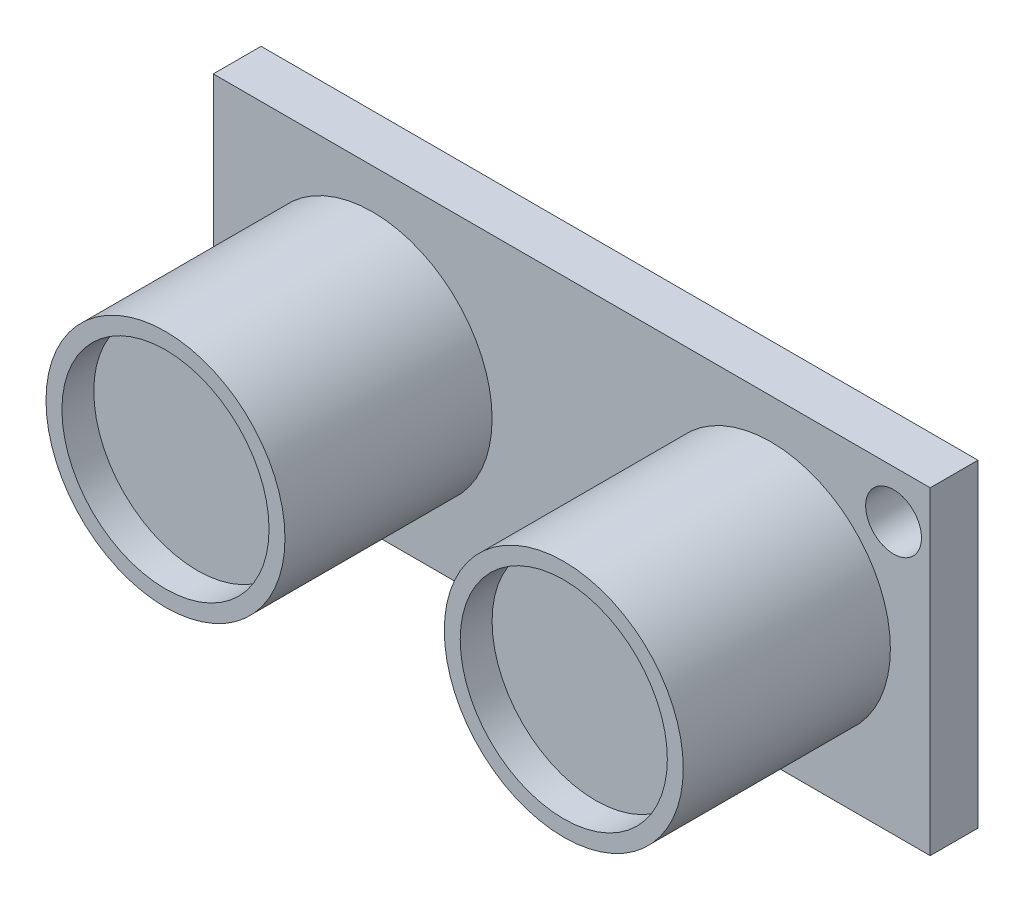
ISO-10303-21;
HEADER;
FILE_DESCRIPTION(('STEP AP214'),'2;1');
FILE_NAME('part.step','',(''),(''),'','','');
FILE_SCHEMA(('AUTOMOTIVE_DESIGN { 1 0 10303 214 1 1 1 1 }'));
ENDSEC;
DATA;
#1=APPLICATION_CONTEXT('core data for automotive mechanical design processes');
#2=APPLICATION_PROTOCOL_DEFINITION('international standard','automotive_design',2000,#1);
#3=PRODUCT_CONTEXT('',#1,'mechanical');
#4=PRODUCT('Part','Part','',(#3));
#5=PRODUCT_RELATED_PRODUCT_CATEGORY('part','',(#4));
#6=PRODUCT_DEFINITION_FORMATION('','',#4);
#7=PRODUCT_DEFINITION_CONTEXT('part definition',#1,'design');
#8=PRODUCT_DEFINITION('design','',#6,#7);
#9=PRODUCT_DEFINITION_SHAPE('','',#8);
#10=(LENGTH_UNIT() NAMED_UNIT(*) SI_UNIT(.MILLI.,.METRE.));
#11=(NAMED_UNIT(*) PLANE_ANGLE_UNIT() SI_UNIT($,.RADIAN.));
#12=(NAMED_UNIT(*) SI_UNIT($,.STERADIAN.) SOLID_ANGLE_UNIT());
#13=UNCERTAINTY_MEASURE_WITH_UNIT(LENGTH_MEASURE(1.E-05),#10,'distance_accuracy_value','');
#14=(GEOMETRIC_REPRESENTATION_CONTEXT(3) GLOBAL_UNCERTAINTY_ASSIGNED_CONTEXT((#13)) GLOBAL_UNIT_ASSIGNED_CONTEXT((#10,
#11,#12)) REPRESENTATION_CONTEXT('',''));
#15=CARTESIAN_POINT('',(0.,0.,0.));
#16=DIRECTION('',(0.,0.,1.));
#17=DIRECTION('',(1.,0.,0.));
#18=AXIS2_PLACEMENT_3D('',#15,#16,#17);
#19=CARTESIAN_POINT('',(22.5,10.,3.));
#20=DIRECTION('',(-1.,0.,0.));
#21=DIRECTION('',(0.,0.,1.));
#22=AXIS2_PLACEMENT_3D('',#19,#20,#21);
#23=PLANE('',#22);
#24=DIRECTION('',(0.,1.,0.));
#25=VECTOR('',#24,1.);
#26=CARTESIAN_POINT('',(22.5,10.,0.));
#27=LINE('',#26,#25);
#28=CARTESIAN_POINT('',(22.5,-10.,0.));
#29=VERTEX_POINT('',#28);
#30=CARTESIAN_POINT('',(22.5,10.,0.));
#31=VERTEX_POINT('',#30);
#32=EDGE_CURVE('E107',#29,#31,#27,.T.);
#33=ORIENTED_EDGE('',*,*,#32,.T.);
#34=DIRECTION('',(0.,0.,-1.));
#35=VECTOR('',#34,1.);
#36=CARTESIAN_POINT('',(22.5,10.,3.));
#37=LINE('',#36,#35);
#38=CARTESIAN_POINT('',(22.5,10.,3.));
#39=VERTEX_POINT('',#38);
#40=EDGE_CURVE('E11',#39,#31,#37,.T.);
#41=ORIENTED_EDGE('',*,*,#40,.F.);
#42=DIRECTION('',(0.,1.,0.));
#43=VECTOR('',#42,1.);
#44=CARTESIAN_POINT('',(22.5,10.,3.));
#45=LINE('',#44,#43);
#46=CARTESIAN_POINT('',(22.5,-10.,3.));
#47=VERTEX_POINT('',#46);
#48=EDGE_CURVE('E91',#47,#39,#45,.T.);
#49=ORIENTED_EDGE('',*,*,#48,.F.);
#50=DIRECTION('',(0.,0.,-1.));
#51=VECTOR('',#50,1.);
#52=CARTESIAN_POINT('',(22.5,-10.,3.));
#53=LINE('',#52,#51);
#54=EDGE_CURVE('E103',#47,#29,#53,.T.);
#55=ORIENTED_EDGE('',*,*,#54,.T.);
#56=EDGE_LOOP('',(#33,#41,#49,#55));
#57=FACE_BOUND('',#56,.T.);
#58=ADVANCED_FACE('F39',(#57),#23,.F.);
#59=CARTESIAN_POINT('',(-22.5,10.,3.));
#60=DIRECTION('',(0.,-1.,0.));
#61=DIRECTION('',(0.,0.,-1.));
#62=AXIS2_PLACEMENT_3D('',#59,#60,#61);
#63=PLANE('',#62);
#64=DIRECTION('',(-1.,0.,0.));
#65=VECTOR('',#64,1.);
#66=CARTESIAN_POINT('',(-22.5,10.,0.));
#67=LINE('',#66,#65);
#68=CARTESIAN_POINT('',(-22.5,10.,0.));
#69=VERTEX_POINT('',#68);
#70=EDGE_CURVE('E96',#31,#69,#67,.T.);
#71=ORIENTED_EDGE('',*,*,#70,.T.);
#72=DIRECTION('',(0.,0.,-1.));
#73=VECTOR('',#72,1.);
#74=CARTESIAN_POINT('',(-22.5,10.,3.));
#75=LINE('',#74,#73);
#76=CARTESIAN_POINT('',(-22.5,10.,3.));
#77=VERTEX_POINT('',#76);
#78=EDGE_CURVE('E48',#77,#69,#75,.T.);
#79=ORIENTED_EDGE('',*,*,#78,.F.);
#80=DIRECTION('',(-1.,0.,0.));
#81=VECTOR('',#80,1.);
#82=CARTESIAN_POINT('',(-22.5,10.,3.));
#83=LINE('',#82,#81);
#84=EDGE_CURVE('E86',#39,#77,#83,.T.);
#85=ORIENTED_EDGE('',*,*,#84,.F.);
#86=ORIENTED_EDGE('',*,*,#40,.T.);
#87=EDGE_LOOP('',(#71,#79,#85,#86));
#88=FACE_BOUND('',#87,.T.);
#89=ADVANCED_FACE('F95',(#88),#63,.F.);
#90=CARTESIAN_POINT('',(-22.5,10.,3.));
#91=DIRECTION('',(1.,0.,0.));
#92=DIRECTION('',(0.,0.,-1.));
#93=AXIS2_PLACEMENT_3D('',#90,#91,#92);
#94=PLANE('',#93);
#95=DIRECTION('',(0.,-1.,0.));
#96=VECTOR('',#95,1.);
#97=CARTESIAN_POINT('',(-22.5,10.,0.));
#98=LINE('',#97,#96);
#99=CARTESIAN_POINT('',(-22.5,-10.,0.));
#100=VERTEX_POINT('',#99);
#101=EDGE_CURVE('E73',#69,#100,#98,.T.);
#102=ORIENTED_EDGE('',*,*,#101,.T.);
#103=DIRECTION('',(0.,0.,-1.));
#104=VECTOR('',#103,1.);
#105=CARTESIAN_POINT('',(-22.5,-10.,3.));
#106=LINE('',#105,#104);
#107=CARTESIAN_POINT('',(-22.5,-10.,3.));
#108=VERTEX_POINT('',#107);
#109=EDGE_CURVE('E98',#108,#100,#106,.T.);
#110=ORIENTED_EDGE('',*,*,#109,.F.);
#111=DIRECTION('',(0.,-1.,0.));
#112=VECTOR('',#111,1.);
#113=CARTESIAN_POINT('',(-22.5,10.,3.));
#114=LINE('',#113,#112);
#115=EDGE_CURVE('E89',#77,#108,#114,.T.);
#116=ORIENTED_EDGE('',*,*,#115,.F.);
#117=ORIENTED_EDGE('',*,*,#78,.T.);
#118=EDGE_LOOP('',(#102,#110,#116,#117));
#119=FACE_BOUND('',#118,.T.);
#120=ADVANCED_FACE('F99',(#119),#94,.F.);
#121=CARTESIAN_POINT('',(-22.5,-10.,3.));
#122=DIRECTION('',(0.,1.,0.));
#123=DIRECTION('',(0.,0.,1.));
#124=AXIS2_PLACEMENT_3D('',#121,#122,#123);
#125=PLANE('',#124);
#126=DIRECTION('',(1.,0.,0.));
#127=VECTOR('',#126,1.);
#128=CARTESIAN_POINT('',(-22.5,-10.,0.));
#129=LINE('',#128,#127);
#130=EDGE_CURVE('E79',#100,#29,#129,.T.);
#131=ORIENTED_EDGE('',*,*,#130,.T.);
#132=ORIENTED_EDGE('',*,*,#54,.F.);
#133=DIRECTION('',(1.,0.,0.));
#134=VECTOR('',#133,1.);
#135=CARTESIAN_POINT('',(-22.5,-10.,3.));
#136=LINE('',#135,#134);
#137=EDGE_CURVE('E56',#108,#47,#136,.T.);
#138=ORIENTED_EDGE('',*,*,#137,.F.);
#139=ORIENTED_EDGE('',*,*,#109,.T.);
#140=EDGE_LOOP('',(#131,#132,#138,#139));
#141=FACE_BOUND('',#140,.T.);
#142=ADVANCED_FACE('F121',(#141),#125,.F.);
#143=CARTESIAN_POINT('',(0.,0.,3.));
#144=DIRECTION('',(0.,0.,1.));
#145=DIRECTION('',(1.,0.,0.));
#146=AXIS2_PLACEMENT_3D('',#143,#144,#145);
#147=PLANE('',#146);
#148=CARTESIAN_POINT('',(20.2,7.,3.));
#149=DIRECTION('',(0.,0.,1.));
#150=DIRECTION('',(1.,0.,0.));
#151=AXIS2_PLACEMENT_3D('',#148,#149,#150);
#152=CIRCLE('',#151,1.75);
#153=CARTESIAN_POINT('',(21.95,7.,3.));
#154=VERTEX_POINT('',#153);
#155=EDGE_CURVE('E140',#154,#154,#152,.T.);
#156=ORIENTED_EDGE('',*,*,#155,.F.);
#157=EDGE_LOOP('',(#156));
#158=FACE_BOUND('',#157,.T.);
#159=CARTESIAN_POINT('',(-20.2,-6.99999999999999,3.));
#160=DIRECTION('',(0.,0.,1.));
#161=DIRECTION('',(1.,0.,0.));
#162=AXIS2_PLACEMENT_3D('',#159,#160,#161);
#163=CIRCLE('',#162,1.75);
#164=CARTESIAN_POINT('',(-18.45,-6.99999999999999,3.));
#165=VERTEX_POINT('',#164);
#166=EDGE_CURVE('E147',#165,#165,#163,.T.);
#167=ORIENTED_EDGE('',*,*,#166,.F.);
#168=EDGE_LOOP('',(#167));
#169=FACE_BOUND('',#168,.T.);
#170=CARTESIAN_POINT('',(-12.5,0.,3.));
#171=DIRECTION('',(0.,0.,1.));
#172=DIRECTION('',(-1.,0.,0.));
#173=AXIS2_PLACEMENT_3D('',#170,#171,#172);
#174=CIRCLE('',#173,7.5);
#175=CARTESIAN_POINT('',(-20.,0.,3.));
#176=VERTEX_POINT('',#175);
#177=EDGE_CURVE('E136',#176,#176,#174,.T.);
#178=ORIENTED_EDGE('',*,*,#177,.F.);
#179=EDGE_LOOP('',(#178));
#180=FACE_BOUND('',#179,.T.);
#181=CARTESIAN_POINT('',(12.5,0.,3.));
#182=DIRECTION('',(0.,0.,1.));
#183=DIRECTION('',(1.,0.,0.));
#184=AXIS2_PLACEMENT_3D('',#181,#182,#183);
#185=CIRCLE('',#184,7.5);
#186=CARTESIAN_POINT('',(20.,0.,3.));
#187=VERTEX_POINT('',#186);
#188=EDGE_CURVE('E128',#187,#187,#185,.T.);
#189=ORIENTED_EDGE('',*,*,#188,.F.);
#190=EDGE_LOOP('',(#189));
#191=FACE_BOUND('',#190,.T.);
#192=ORIENTED_EDGE('',*,*,#48,.T.);
#193=ORIENTED_EDGE('',*,*,#84,.T.);
#194=ORIENTED_EDGE('',*,*,#115,.T.);
#195=ORIENTED_EDGE('',*,*,#137,.T.);
#196=EDGE_LOOP('',(#192,#193,#194,#195));
#197=FACE_BOUND('',#196,.T.);
#198=ADVANCED_FACE('F87',(#158,#169,#180,#191,#197),#147,.T.);
#199=CARTESIAN_POINT('',(0.,0.,0.));
#200=DIRECTION('',(0.,0.,1.));
#201=DIRECTION('',(1.,0.,0.));
#202=AXIS2_PLACEMENT_3D('',#199,#200,#201);
#203=PLANE('',#202);
#204=CARTESIAN_POINT('',(20.2,7.,0.));
#205=DIRECTION('',(0.,0.,1.));
#206=DIRECTION('',(1.,0.,0.));
#207=AXIS2_PLACEMENT_3D('',#204,#205,#206);
#208=CIRCLE('',#207,1.75);
#209=CARTESIAN_POINT('',(21.95,7.,0.));
#210=VERTEX_POINT('',#209);
#211=EDGE_CURVE('E151',#210,#210,#208,.T.);
#212=ORIENTED_EDGE('',*,*,#211,.T.);
#213=EDGE_LOOP('',(#212));
#214=FACE_BOUND('',#213,.T.);
#215=CARTESIAN_POINT('',(-20.2,-6.99999999999999,0.));
#216=DIRECTION('',(0.,0.,1.));
#217=DIRECTION('',(1.,0.,0.));
#218=AXIS2_PLACEMENT_3D('',#215,#216,#217);
#219=CIRCLE('',#218,1.75);
#220=CARTESIAN_POINT('',(-18.45,-6.99999999999999,0.));
#221=VERTEX_POINT('',#220);
#222=EDGE_CURVE('E152',#221,#221,#219,.T.);
#223=ORIENTED_EDGE('',*,*,#222,.T.);
#224=EDGE_LOOP('',(#223));
#225=FACE_BOUND('',#224,.T.);
#226=ORIENTED_EDGE('',*,*,#32,.F.);
#227=ORIENTED_EDGE('',*,*,#130,.F.);
#228=ORIENTED_EDGE('',*,*,#101,.F.);
#229=ORIENTED_EDGE('',*,*,#70,.F.);
#230=EDGE_LOOP('',(#226,#227,#228,#229));
#231=FACE_BOUND('',#230,.T.);
#232=ADVANCED_FACE('F124',(#214,#225,#231),#203,.F.);
#233=CARTESIAN_POINT('',(12.5,0.,16.));
#234=DIRECTION('',(0.,0.,-1.));
#235=DIRECTION('',(-1.,0.,0.));
#236=AXIS2_PLACEMENT_3D('',#233,#234,#235);
#237=CYLINDRICAL_SURFACE('',#236,7.5);
#238=CARTESIAN_POINT('',(12.5,0.,16.));
#239=DIRECTION('',(0.,0.,1.));
#240=DIRECTION('',(1.,0.,0.));
#241=AXIS2_PLACEMENT_3D('',#238,#239,#240);
#242=CIRCLE('',#241,7.5);
#243=CARTESIAN_POINT('',(20.,0.,16.));
#244=VERTEX_POINT('',#243);
#245=EDGE_CURVE('E111',#244,#244,#242,.T.);
#246=ORIENTED_EDGE('',*,*,#245,.F.);
#247=EDGE_LOOP('',(#246));
#248=FACE_BOUND('',#247,.T.);
#249=ORIENTED_EDGE('',*,*,#188,.T.);
#250=EDGE_LOOP('',(#249));
#251=FACE_BOUND('',#250,.T.);
#252=ADVANCED_FACE('F205',(#248,#251),#237,.T.);
#253=CARTESIAN_POINT('',(12.5,0.,16.));
#254=DIRECTION('',(0.,0.,1.));
#255=DIRECTION('',(1.,0.,0.));
#256=AXIS2_PLACEMENT_3D('',#253,#254,#255);
#257=PLANE('',#256);
#258=CARTESIAN_POINT('',(12.5,0.,16.));
#259=DIRECTION('',(0.,0.,1.));
#260=DIRECTION('',(1.,0.,0.));
#261=AXIS2_PLACEMENT_3D('',#258,#259,#260);
#262=CIRCLE('',#261,6.5);
#263=CARTESIAN_POINT('',(19.,0.,16.));
#264=VERTEX_POINT('',#263);
#265=EDGE_CURVE('E160',#264,#264,#262,.T.);
#266=ORIENTED_EDGE('',*,*,#265,.F.);
#267=EDGE_LOOP('',(#266));
#268=FACE_BOUND('',#267,.T.);
#269=ORIENTED_EDGE('',*,*,#245,.T.);
#270=EDGE_LOOP('',(#269));
#271=FACE_BOUND('',#270,.T.);
#272=ADVANCED_FACE('F195',(#268,#271),#257,.T.);
#273=CARTESIAN_POINT('',(-12.5,0.,16.));
#274=DIRECTION('',(0.,0.,-1.));
#275=DIRECTION('',(-1.,0.,0.));
#276=AXIS2_PLACEMENT_3D('',#273,#274,#275);
#277=CYLINDRICAL_SURFACE('',#276,7.5);
#278=CARTESIAN_POINT('',(-12.5,0.,16.));
#279=DIRECTION('',(0.,0.,1.));
#280=DIRECTION('',(-1.,0.,0.));
#281=AXIS2_PLACEMENT_3D('',#278,#279,#280);
#282=CIRCLE('',#281,7.5);
#283=CARTESIAN_POINT('',(-20.,0.,16.));
#284=VERTEX_POINT('',#283);
#285=EDGE_CURVE('E132',#284,#284,#282,.T.);
#286=ORIENTED_EDGE('',*,*,#285,.F.);
#287=EDGE_LOOP('',(#286));
#288=FACE_BOUND('',#287,.T.);
#289=ORIENTED_EDGE('',*,*,#177,.T.);
#290=EDGE_LOOP('',(#289));
#291=FACE_BOUND('',#290,.T.);
#292=ADVANCED_FACE('F189',(#288,#291),#277,.T.);
#293=CARTESIAN_POINT('',(-12.5,0.,16.));
#294=DIRECTION('',(0.,0.,-1.));
#295=DIRECTION('',(-1.,0.,0.));
#296=AXIS2_PLACEMENT_3D('',#293,#294,#295);
#297=PLANE('',#296);
#298=CARTESIAN_POINT('',(-12.5,0.,16.));
#299=DIRECTION('',(0.,0.,1.));
#300=DIRECTION('',(1.,0.,0.));
#301=AXIS2_PLACEMENT_3D('',#298,#299,#300);
#302=CIRCLE('',#301,6.5);
#303=CARTESIAN_POINT('',(-5.99999999999999,0.,16.));
#304=VERTEX_POINT('',#303);
#305=EDGE_CURVE('E168',#304,#304,#302,.T.);
#306=ORIENTED_EDGE('',*,*,#305,.F.);
#307=EDGE_LOOP('',(#306));
#308=FACE_BOUND('',#307,.T.);
#309=ORIENTED_EDGE('',*,*,#285,.T.);
#310=EDGE_LOOP('',(#309));
#311=FACE_BOUND('',#310,.T.);
#312=ADVANCED_FACE('F185',(#308,#311),#297,.F.);
#313=CARTESIAN_POINT('',(-20.2,-6.99999999999999,0.));
#314=DIRECTION('',(0.,0.,1.));
#315=DIRECTION('',(1.,0.,0.));
#316=AXIS2_PLACEMENT_3D('',#313,#314,#315);
#317=CYLINDRICAL_SURFACE('',#316,1.75);
#318=ORIENTED_EDGE('',*,*,#166,.T.);
#319=EDGE_LOOP('',(#318));
#320=FACE_BOUND('',#319,.T.);
#321=ORIENTED_EDGE('',*,*,#222,.F.);
#322=EDGE_LOOP('',(#321));
#323=FACE_BOUND('',#322,.T.);
#324=ADVANCED_FACE('F188',(#320,#323),#317,.F.);
#325=CARTESIAN_POINT('',(20.2,7.,0.));
#326=DIRECTION('',(0.,0.,1.));
#327=DIRECTION('',(1.,0.,0.));
#328=AXIS2_PLACEMENT_3D('',#325,#326,#327);
#329=CYLINDRICAL_SURFACE('',#328,1.75);
#330=ORIENTED_EDGE('',*,*,#155,.T.);
#331=EDGE_LOOP('',(#330));
#332=FACE_BOUND('',#331,.T.);
#333=ORIENTED_EDGE('',*,*,#211,.F.);
#334=EDGE_LOOP('',(#333));
#335=FACE_BOUND('',#334,.T.);
#336=ADVANCED_FACE('F181',(#332,#335),#329,.F.);
#337=CARTESIAN_POINT('',(-12.5,0.,14.));
#338=DIRECTION('',(0.,0.,1.));
#339=DIRECTION('',(1.,0.,0.));
#340=AXIS2_PLACEMENT_3D('',#337,#338,#339);
#341=CYLINDRICAL_SURFACE('',#340,6.5);
#342=CARTESIAN_POINT('',(-12.5,0.,14.));
#343=DIRECTION('',(0.,0.,1.));
#344=DIRECTION('',(1.,0.,0.));
#345=AXIS2_PLACEMENT_3D('',#342,#343,#344);
#346=CIRCLE('',#345,6.5);
#347=CARTESIAN_POINT('',(-5.99999999999999,0.,14.));
#348=VERTEX_POINT('',#347);
#349=EDGE_CURVE('E156',#348,#348,#346,.T.);
#350=ORIENTED_EDGE('',*,*,#349,.F.);
#351=EDGE_LOOP('',(#350));
#352=FACE_BOUND('',#351,.T.);
#353=ORIENTED_EDGE('',*,*,#305,.T.);
#354=EDGE_LOOP('',(#353));
#355=FACE_BOUND('',#354,.T.);
#356=ADVANCED_FACE('F178',(#352,#355),#341,.F.);
#357=CARTESIAN_POINT('',(0.,0.,14.));
#358=DIRECTION('',(0.,0.,1.));
#359=DIRECTION('',(1.,0.,0.));
#360=AXIS2_PLACEMENT_3D('',#357,#358,#359);
#361=PLANE('',#360);
#362=ORIENTED_EDGE('',*,*,#349,.T.);
#363=EDGE_LOOP('',(#362));
#364=FACE_BOUND('',#363,.T.);
#365=ADVANCED_FACE('F176',(#364),#361,.T.);
#366=CARTESIAN_POINT('',(12.5,0.,14.));
#367=DIRECTION('',(0.,0.,1.));
#368=DIRECTION('',(1.,0.,0.));
#369=AXIS2_PLACEMENT_3D('',#366,#367,#368);
#370=CYLINDRICAL_SURFACE('',#369,6.5);
#371=CARTESIAN_POINT('',(12.5,0.,14.));
#372=DIRECTION('',(0.,0.,1.));
#373=DIRECTION('',(1.,0.,0.));
#374=AXIS2_PLACEMENT_3D('',#371,#372,#373);
#375=CIRCLE('',#374,6.5);
#376=CARTESIAN_POINT('',(19.,0.,14.));
#377=VERTEX_POINT('',#376);
#378=EDGE_CURVE('E164',#377,#377,#375,.T.);
#379=ORIENTED_EDGE('',*,*,#378,.F.);
#380=EDGE_LOOP('',(#379));
#381=FACE_BOUND('',#380,.T.);
#382=ORIENTED_EDGE('',*,*,#265,.T.);
#383=EDGE_LOOP('',(#382));
#384=FACE_BOUND('',#383,.T.);
#385=ADVANCED_FACE('F288',(#381,#384),#370,.F.);
#386=CARTESIAN_POINT('',(0.,0.,14.));
#387=DIRECTION('',(0.,0.,1.));
#388=DIRECTION('',(1.,0.,0.));
#389=AXIS2_PLACEMENT_3D('',#386,#387,#388);
#390=PLANE('',#389);
#391=ORIENTED_EDGE('',*,*,#378,.T.);
#392=EDGE_LOOP('',(#391));
#393=FACE_BOUND('',#392,.T.);
#394=ADVANCED_FACE('F297',(#393),#390,.T.);
#395=CLOSED_SHELL('',(#58,#89,#120,#142,#198,#232,#252,#272,#292,#312,#324,#336,#356,#365,#385,#394));
#396=MANIFOLD_SOLID_BREP('B2',#395);
#397=ADVANCED_BREP_SHAPE_REPRESENTATION('',(#18,#396),#14);
#398=SHAPE_DEFINITION_REPRESENTATION(#9,#397);
ENDSEC;
END-ISO-10303-21;
